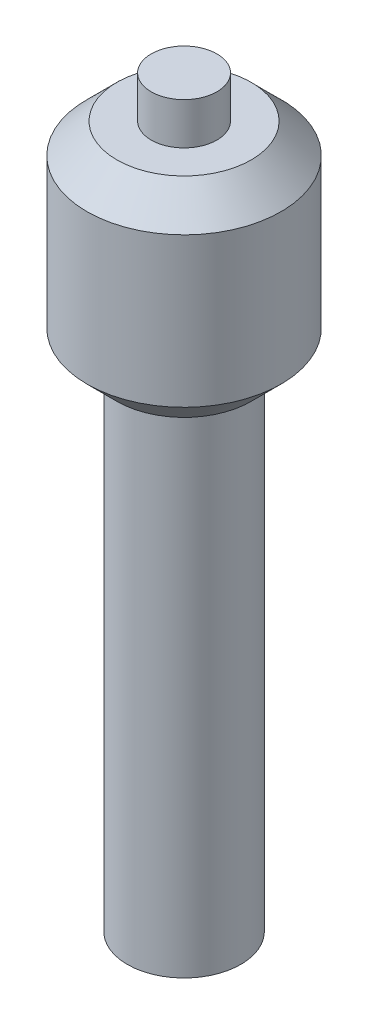
ISO-10303-21;
HEADER;
FILE_DESCRIPTION(('STEP AP214'),'2;1');
FILE_NAME('part.step','',(''),(''),'','','');
FILE_SCHEMA(('AUTOMOTIVE_DESIGN { 1 0 10303 214 1 1 1 1 }'));
ENDSEC;
DATA;
#1=APPLICATION_CONTEXT('core data for automotive mechanical design processes');
#2=APPLICATION_PROTOCOL_DEFINITION('international standard','automotive_design',2000,#1);
#3=PRODUCT_CONTEXT('',#1,'mechanical');
#4=PRODUCT('Part','Part','',(#3));
#5=PRODUCT_RELATED_PRODUCT_CATEGORY('part','',(#4));
#6=PRODUCT_DEFINITION_FORMATION('','',#4);
#7=PRODUCT_DEFINITION_CONTEXT('part definition',#1,'design');
#8=PRODUCT_DEFINITION('design','',#6,#7);
#9=PRODUCT_DEFINITION_SHAPE('','',#8);
#10=(LENGTH_UNIT() NAMED_UNIT(*) SI_UNIT(.MILLI.,.METRE.));
#11=(NAMED_UNIT(*) PLANE_ANGLE_UNIT() SI_UNIT($,.RADIAN.));
#12=(NAMED_UNIT(*) SI_UNIT($,.STERADIAN.) SOLID_ANGLE_UNIT());
#13=UNCERTAINTY_MEASURE_WITH_UNIT(LENGTH_MEASURE(1.E-05),#10,'distance_accuracy_value','');
#14=(GEOMETRIC_REPRESENTATION_CONTEXT(3) GLOBAL_UNCERTAINTY_ASSIGNED_CONTEXT((#13)) GLOBAL_UNIT_ASSIGNED_CONTEXT((#10,
#11,#12)) REPRESENTATION_CONTEXT('',''));
#15=CARTESIAN_POINT('',(0.,0.,0.));
#16=DIRECTION('',(0.,0.,1.));
#17=DIRECTION('',(1.,0.,0.));
#18=AXIS2_PLACEMENT_3D('',#15,#16,#17);
#19=CARTESIAN_POINT('',(0.,15.4424822757351,0.));
#20=DIRECTION('',(0.,1.,0.));
#21=DIRECTION('',(0.,0.,1.));
#22=AXIS2_PLACEMENT_3D('',#19,#20,#21);
#23=PLANE('',#22);
#24=CARTESIAN_POINT('',(0.,15.4424822757351,0.));
#25=DIRECTION('',(0.,1.,0.));
#26=DIRECTION('',(0.,0.,1.));
#27=AXIS2_PLACEMENT_3D('',#24,#25,#26);
#28=CIRCLE('',#27,19.);
#29=CARTESIAN_POINT('',(0.,15.4424822757351,19.));
#30=VERTEX_POINT('',#29);
#31=EDGE_CURVE('E10',#30,#30,#28,.T.);
#32=ORIENTED_EDGE('',*,*,#31,.F.);
#33=EDGE_LOOP('',(#32));
#34=FACE_BOUND('',#33,.T.);
#35=ADVANCED_FACE('F31',(#34),#23,.F.);
#36=CARTESIAN_POINT('',(0.,309.181995893382,0.));
#37=DIRECTION('',(0.,1.,0.));
#38=DIRECTION('',(0.,0.,1.));
#39=AXIS2_PLACEMENT_3D('',#36,#37,#38);
#40=CYLINDRICAL_SURFACE('',#39,19.);
#41=CARTESIAN_POINT('',(0.,180.442482275735,0.));
#42=DIRECTION('',(0.,1.,0.));
#43=DIRECTION('',(0.,0.,1.));
#44=AXIS2_PLACEMENT_3D('',#41,#42,#43);
#45=CIRCLE('',#44,19.);
#46=CARTESIAN_POINT('',(0.,180.442482275735,19.));
#47=VERTEX_POINT('',#46);
#48=EDGE_CURVE('E37',#47,#47,#45,.T.);
#49=ORIENTED_EDGE('',*,*,#48,.F.);
#50=EDGE_LOOP('',(#49));
#51=FACE_BOUND('',#50,.T.);
#52=ORIENTED_EDGE('',*,*,#31,.T.);
#53=EDGE_LOOP('',(#52));
#54=FACE_BOUND('',#53,.T.);
#55=ADVANCED_FACE('F97',(#51,#54),#40,.T.);
#56=CARTESIAN_POINT('',(22.5,180.442482275735,0.));
#57=DIRECTION('',(0.,1.,0.));
#58=DIRECTION('',(0.,0.,1.));
#59=AXIS2_PLACEMENT_3D('',#56,#57,#58);
#60=PLANE('',#59);
#61=CARTESIAN_POINT('',(0.,180.442482275735,0.));
#62=DIRECTION('',(0.,1.,0.));
#63=DIRECTION('',(0.,0.,1.));
#64=AXIS2_PLACEMENT_3D('',#61,#62,#63);
#65=CIRCLE('',#64,22.5);
#66=CARTESIAN_POINT('',(0.,180.442482275735,22.5));
#67=VERTEX_POINT('',#66);
#68=EDGE_CURVE('E41',#67,#67,#65,.T.);
#69=ORIENTED_EDGE('',*,*,#68,.F.);
#70=EDGE_LOOP('',(#69));
#71=FACE_BOUND('',#70,.T.);
#72=ORIENTED_EDGE('',*,*,#48,.T.);
#73=EDGE_LOOP('',(#72));
#74=FACE_BOUND('',#73,.T.);
#75=ADVANCED_FACE('F92',(#71,#74),#60,.F.);
#76=CARTESIAN_POINT('',(0.,180.442482275735,0.));
#77=DIRECTION('',(0.,1.,0.));
#78=DIRECTION('',(0.,0.,1.));
#79=AXIS2_PLACEMENT_3D('',#76,#77,#78);
#80=CONICAL_SURFACE('',#79,22.5,0.785398163397446);
#81=CARTESIAN_POINT('',(0.,190.442482275735,0.));
#82=DIRECTION('',(0.,1.,0.));
#83=DIRECTION('',(0.,0.,1.));
#84=AXIS2_PLACEMENT_3D('',#81,#82,#83);
#85=CIRCLE('',#84,32.5);
#86=CARTESIAN_POINT('',(0.,190.442482275735,32.5));
#87=VERTEX_POINT('',#86);
#88=EDGE_CURVE('E45',#87,#87,#85,.T.);
#89=ORIENTED_EDGE('',*,*,#88,.F.);
#90=EDGE_LOOP('',(#89));
#91=FACE_BOUND('',#90,.T.);
#92=ORIENTED_EDGE('',*,*,#68,.T.);
#93=EDGE_LOOP('',(#92));
#94=FACE_BOUND('',#93,.T.);
#95=ADVANCED_FACE('F86',(#91,#94),#80,.T.);
#96=CARTESIAN_POINT('',(0.,309.181995893382,0.));
#97=DIRECTION('',(0.,1.,0.));
#98=DIRECTION('',(0.,0.,1.));
#99=AXIS2_PLACEMENT_3D('',#96,#97,#98);
#100=CYLINDRICAL_SURFACE('',#99,32.5);
#101=CARTESIAN_POINT('',(0.,240.442482275735,0.));
#102=DIRECTION('',(0.,1.,0.));
#103=DIRECTION('',(0.,0.,1.));
#104=AXIS2_PLACEMENT_3D('',#101,#102,#103);
#105=CIRCLE('',#104,32.5);
#106=CARTESIAN_POINT('',(0.,240.442482275735,32.5));
#107=VERTEX_POINT('',#106);
#108=EDGE_CURVE('E50',#107,#107,#105,.T.);
#109=ORIENTED_EDGE('',*,*,#108,.F.);
#110=EDGE_LOOP('',(#109));
#111=FACE_BOUND('',#110,.T.);
#112=ORIENTED_EDGE('',*,*,#88,.T.);
#113=EDGE_LOOP('',(#112));
#114=FACE_BOUND('',#113,.T.);
#115=ADVANCED_FACE('F80',(#111,#114),#100,.T.);
#116=CARTESIAN_POINT('',(0.,240.442482275735,0.));
#117=DIRECTION('',(0.,-1.,0.));
#118=DIRECTION('',(0.,0.,-1.));
#119=AXIS2_PLACEMENT_3D('',#116,#117,#118);
#120=CONICAL_SURFACE('',#119,32.5,0.785398163397448);
#121=CARTESIAN_POINT('',(0.,250.442482275735,0.));
#122=DIRECTION('',(0.,1.,0.));
#123=DIRECTION('',(0.,0.,1.));
#124=AXIS2_PLACEMENT_3D('',#121,#122,#123);
#125=CIRCLE('',#124,22.5);
#126=CARTESIAN_POINT('',(0.,250.442482275735,22.5));
#127=VERTEX_POINT('',#126);
#128=EDGE_CURVE('E53',#127,#127,#125,.T.);
#129=ORIENTED_EDGE('',*,*,#128,.F.);
#130=EDGE_LOOP('',(#129));
#131=FACE_BOUND('',#130,.T.);
#132=ORIENTED_EDGE('',*,*,#108,.T.);
#133=EDGE_LOOP('',(#132));
#134=FACE_BOUND('',#133,.T.);
#135=ADVANCED_FACE('F74',(#131,#134),#120,.T.);
#136=CARTESIAN_POINT('',(11.,250.442482275735,0.));
#137=DIRECTION('',(0.,-1.,0.));
#138=DIRECTION('',(0.,0.,-1.));
#139=AXIS2_PLACEMENT_3D('',#136,#137,#138);
#140=PLANE('',#139);
#141=CARTESIAN_POINT('',(0.,250.442482275735,0.));
#142=DIRECTION('',(0.,1.,0.));
#143=DIRECTION('',(0.,0.,1.));
#144=AXIS2_PLACEMENT_3D('',#141,#142,#143);
#145=CIRCLE('',#144,11.);
#146=CARTESIAN_POINT('',(0.,250.442482275735,11.));
#147=VERTEX_POINT('',#146);
#148=EDGE_CURVE('E56',#147,#147,#145,.T.);
#149=ORIENTED_EDGE('',*,*,#148,.F.);
#150=EDGE_LOOP('',(#149));
#151=FACE_BOUND('',#150,.T.);
#152=ORIENTED_EDGE('',*,*,#128,.T.);
#153=EDGE_LOOP('',(#152));
#154=FACE_BOUND('',#153,.T.);
#155=ADVANCED_FACE('F68',(#151,#154),#140,.F.);
#156=CARTESIAN_POINT('',(0.,309.181995893382,0.));
#157=DIRECTION('',(0.,1.,0.));
#158=DIRECTION('',(0.,0.,1.));
#159=AXIS2_PLACEMENT_3D('',#156,#157,#158);
#160=CYLINDRICAL_SURFACE('',#159,11.);
#161=CARTESIAN_POINT('',(0.,264.442482275735,0.));
#162=DIRECTION('',(0.,1.,0.));
#163=DIRECTION('',(0.,0.,1.));
#164=AXIS2_PLACEMENT_3D('',#161,#162,#163);
#165=CIRCLE('',#164,11.);
#166=CARTESIAN_POINT('',(0.,264.442482275735,11.));
#167=VERTEX_POINT('',#166);
#168=EDGE_CURVE('E59',#167,#167,#165,.T.);
#169=ORIENTED_EDGE('',*,*,#168,.F.);
#170=EDGE_LOOP('',(#169));
#171=FACE_BOUND('',#170,.T.);
#172=ORIENTED_EDGE('',*,*,#148,.T.);
#173=EDGE_LOOP('',(#172));
#174=FACE_BOUND('',#173,.T.);
#175=ADVANCED_FACE('F65',(#171,#174),#160,.T.);
#176=CARTESIAN_POINT('',(11.,264.442482275735,0.));
#177=DIRECTION('',(0.,-1.,0.));
#178=DIRECTION('',(0.,0.,-1.));
#179=AXIS2_PLACEMENT_3D('',#176,#177,#178);
#180=PLANE('',#179);
#181=ORIENTED_EDGE('',*,*,#168,.T.);
#182=EDGE_LOOP('',(#181));
#183=FACE_BOUND('',#182,.T.);
#184=ADVANCED_FACE('F63',(#183),#180,.F.);
#185=CLOSED_SHELL('',(#35,#55,#75,#95,#115,#135,#155,#175,#184));
#186=MANIFOLD_SOLID_BREP('B2',#185);
#187=ADVANCED_BREP_SHAPE_REPRESENTATION('',(#18,#186),#14);
#188=SHAPE_DEFINITION_REPRESENTATION(#9,#187);
ENDSEC;
END-ISO-10303-21;
